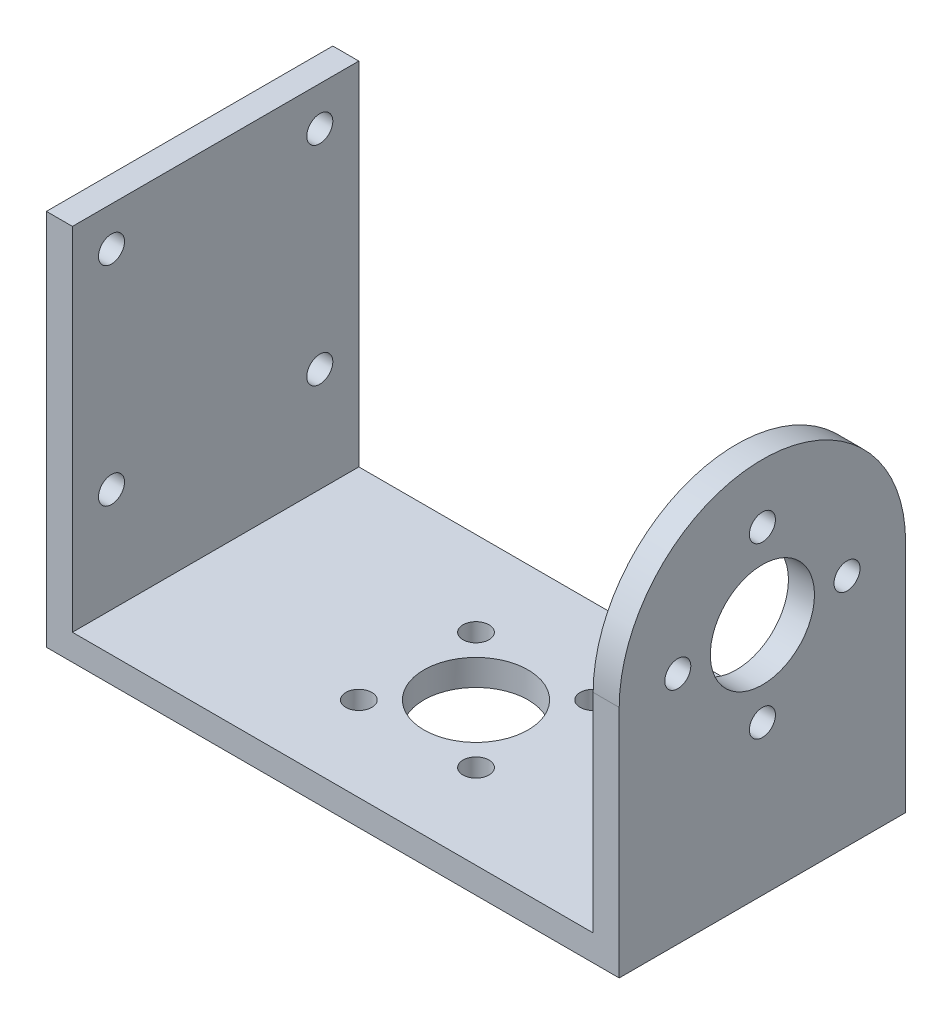
ISO-10303-21;
HEADER;
FILE_DESCRIPTION(('STEP AP214'),'2;1');
FILE_NAME('part.step','',(''),(''),'','','');
FILE_SCHEMA(('AUTOMOTIVE_DESIGN { 1 0 10303 214 1 1 1 1 }'));
ENDSEC;
DATA;
#1=APPLICATION_CONTEXT('core data for automotive mechanical design processes');
#2=APPLICATION_PROTOCOL_DEFINITION('international standard','automotive_design',2000,#1);
#3=PRODUCT_CONTEXT('',#1,'mechanical');
#4=PRODUCT('Part','Part','',(#3));
#5=PRODUCT_RELATED_PRODUCT_CATEGORY('part','',(#4));
#6=PRODUCT_DEFINITION_FORMATION('','',#4);
#7=PRODUCT_DEFINITION_CONTEXT('part definition',#1,'design');
#8=PRODUCT_DEFINITION('design','',#6,#7);
#9=PRODUCT_DEFINITION_SHAPE('','',#8);
#10=(LENGTH_UNIT() NAMED_UNIT(*) SI_UNIT(.MILLI.,.METRE.));
#11=(NAMED_UNIT(*) PLANE_ANGLE_UNIT() SI_UNIT($,.RADIAN.));
#12=(NAMED_UNIT(*) SI_UNIT($,.STERADIAN.) SOLID_ANGLE_UNIT());
#13=UNCERTAINTY_MEASURE_WITH_UNIT(LENGTH_MEASURE(1.E-05),#10,'distance_accuracy_value','');
#14=(GEOMETRIC_REPRESENTATION_CONTEXT(3) GLOBAL_UNCERTAINTY_ASSIGNED_CONTEXT((#13)) GLOBAL_UNIT_ASSIGNED_CONTEXT((#10,
#11,#12)) REPRESENTATION_CONTEXT('',''));
#15=CARTESIAN_POINT('',(0.,0.,0.));
#16=DIRECTION('',(0.,0.,1.));
#17=DIRECTION('',(1.,0.,0.));
#18=AXIS2_PLACEMENT_3D('',#15,#16,#17);
#19=CARTESIAN_POINT('',(0.,2.,-22.));
#20=DIRECTION('',(0.,0.,1.));
#21=DIRECTION('',(1.,0.,0.));
#22=AXIS2_PLACEMENT_3D('',#19,#20,#21);
#23=PLANE('',#22);
#24=DIRECTION('',(1.,0.,0.));
#25=VECTOR('',#24,1.);
#26=CARTESIAN_POINT('',(-0.001000000000001,18.,-22.));
#27=LINE('',#26,#25);
#28=CARTESIAN_POINT('',(42.,18.,-22.));
#29=VERTEX_POINT('',#28);
#30=CARTESIAN_POINT('',(44.,18.,-22.));
#31=VERTEX_POINT('',#30);
#32=EDGE_CURVE('E132',#29,#31,#27,.T.);
#33=ORIENTED_EDGE('',*,*,#32,.T.);
#34=DIRECTION('',(0.,-1.,0.));
#35=VECTOR('',#34,1.);
#36=CARTESIAN_POINT('',(44.,2.,-22.));
#37=LINE('',#36,#35);
#38=CARTESIAN_POINT('',(44.,0.,-22.));
#39=VERTEX_POINT('',#38);
#40=EDGE_CURVE('E129',#31,#39,#37,.T.);
#41=ORIENTED_EDGE('',*,*,#40,.T.);
#42=DIRECTION('',(-1.,0.,0.));
#43=VECTOR('',#42,1.);
#44=CARTESIAN_POINT('',(0.,0.,-22.));
#45=LINE('',#44,#43);
#46=CARTESIAN_POINT('',(0.,0.,-22.));
#47=VERTEX_POINT('',#46);
#48=EDGE_CURVE('E247',#39,#47,#45,.T.);
#49=ORIENTED_EDGE('',*,*,#48,.T.);
#50=DIRECTION('',(0.,-1.,0.));
#51=VECTOR('',#50,1.);
#52=CARTESIAN_POINT('',(0.,2.,-22.));
#53=LINE('',#52,#51);
#54=CARTESIAN_POINT('',(0.,29.,-22.));
#55=VERTEX_POINT('',#54);
#56=EDGE_CURVE('E144',#55,#47,#53,.T.);
#57=ORIENTED_EDGE('',*,*,#56,.F.);
#58=DIRECTION('',(-1.,0.,0.));
#59=VECTOR('',#58,1.);
#60=CARTESIAN_POINT('',(0.,29.,-22.));
#61=LINE('',#60,#59);
#62=CARTESIAN_POINT('',(2.,29.,-22.));
#63=VERTEX_POINT('',#62);
#64=EDGE_CURVE('E233',#63,#55,#61,.T.);
#65=ORIENTED_EDGE('',*,*,#64,.F.);
#66=DIRECTION('',(0.,-1.,0.));
#67=VECTOR('',#66,1.);
#68=CARTESIAN_POINT('',(2.,29.,-22.));
#69=LINE('',#68,#67);
#70=CARTESIAN_POINT('',(2.,2.,-22.));
#71=VERTEX_POINT('',#70);
#72=EDGE_CURVE('E236',#63,#71,#69,.T.);
#73=ORIENTED_EDGE('',*,*,#72,.T.);
#74=DIRECTION('',(-1.,0.,0.));
#75=VECTOR('',#74,1.);
#76=CARTESIAN_POINT('',(0.,2.,-22.));
#77=LINE('',#76,#75);
#78=CARTESIAN_POINT('',(42.,2.,-22.));
#79=VERTEX_POINT('',#78);
#80=EDGE_CURVE('E246',#79,#71,#77,.T.);
#81=ORIENTED_EDGE('',*,*,#80,.F.);
#82=DIRECTION('',(0.,-1.,0.));
#83=VECTOR('',#82,1.);
#84=CARTESIAN_POINT('',(42.,29.,-22.));
#85=LINE('',#84,#83);
#86=EDGE_CURVE('E224',#29,#79,#85,.T.);
#87=ORIENTED_EDGE('',*,*,#86,.F.);
#88=EDGE_LOOP('',(#33,#41,#49,#57,#65,#73,#81,#87));
#89=FACE_BOUND('',#88,.T.);
#90=ADVANCED_FACE('F56',(#89),#23,.F.);
#91=CARTESIAN_POINT('',(0.,2.,0.));
#92=DIRECTION('',(0.,-1.,0.));
#93=DIRECTION('',(0.,0.,-1.));
#94=AXIS2_PLACEMENT_3D('',#91,#92,#93);
#95=PLANE('',#94);
#96=CARTESIAN_POINT('',(17.5,2.,-6.5));
#97=DIRECTION('',(0.,1.,0.));
#98=DIRECTION('',(0.,0.,1.));
#99=AXIS2_PLACEMENT_3D('',#96,#97,#98);
#100=CIRCLE('',#99,1.);
#101=CARTESIAN_POINT('',(17.5,2.,-5.5));
#102=VERTEX_POINT('',#101);
#103=EDGE_CURVE('E403',#102,#102,#100,.T.);
#104=ORIENTED_EDGE('',*,*,#103,.F.);
#105=EDGE_LOOP('',(#104));
#106=FACE_BOUND('',#105,.T.);
#107=CARTESIAN_POINT('',(17.5,2.,-15.5));
#108=DIRECTION('',(0.,1.,0.));
#109=DIRECTION('',(0.,0.,1.));
#110=AXIS2_PLACEMENT_3D('',#107,#108,#109);
#111=CIRCLE('',#110,1.);
#112=CARTESIAN_POINT('',(17.5,2.,-14.5));
#113=VERTEX_POINT('',#112);
#114=EDGE_CURVE('E400',#113,#113,#111,.T.);
#115=ORIENTED_EDGE('',*,*,#114,.F.);
#116=EDGE_LOOP('',(#115));
#117=FACE_BOUND('',#116,.T.);
#118=CARTESIAN_POINT('',(22.,2.,-11.));
#119=DIRECTION('',(0.,1.,0.));
#120=DIRECTION('',(0.,0.,1.));
#121=AXIS2_PLACEMENT_3D('',#118,#119,#120);
#122=CIRCLE('',#121,4.);
#123=CARTESIAN_POINT('',(22.,2.,-7.));
#124=VERTEX_POINT('',#123);
#125=EDGE_CURVE('E395',#124,#124,#122,.T.);
#126=ORIENTED_EDGE('',*,*,#125,.F.);
#127=EDGE_LOOP('',(#126));
#128=FACE_BOUND('',#127,.T.);
#129=CARTESIAN_POINT('',(26.5,2.,-15.5));
#130=DIRECTION('',(0.,1.,0.));
#131=DIRECTION('',(0.,0.,1.));
#132=AXIS2_PLACEMENT_3D('',#129,#130,#131);
#133=CIRCLE('',#132,1.);
#134=CARTESIAN_POINT('',(26.5,2.,-14.5));
#135=VERTEX_POINT('',#134);
#136=EDGE_CURVE('E397',#135,#135,#133,.T.);
#137=ORIENTED_EDGE('',*,*,#136,.F.);
#138=EDGE_LOOP('',(#137));
#139=FACE_BOUND('',#138,.T.);
#140=CARTESIAN_POINT('',(26.5,2.,-6.5));
#141=DIRECTION('',(0.,1.,0.));
#142=DIRECTION('',(0.,0.,1.));
#143=AXIS2_PLACEMENT_3D('',#140,#141,#142);
#144=CIRCLE('',#143,1.);
#145=CARTESIAN_POINT('',(26.5,2.,-5.5));
#146=VERTEX_POINT('',#145);
#147=EDGE_CURVE('E152',#146,#146,#144,.T.);
#148=ORIENTED_EDGE('',*,*,#147,.F.);
#149=EDGE_LOOP('',(#148));
#150=FACE_BOUND('',#149,.T.);
#151=DIRECTION('',(0.,0.,1.));
#152=VECTOR('',#151,1.);
#153=CARTESIAN_POINT('',(42.,2.,-22.));
#154=LINE('',#153,#152);
#155=CARTESIAN_POINT('',(42.,2.,0.));
#156=VERTEX_POINT('',#155);
#157=EDGE_CURVE('E220',#79,#156,#154,.T.);
#158=ORIENTED_EDGE('',*,*,#157,.F.);
#159=ORIENTED_EDGE('',*,*,#80,.T.);
#160=DIRECTION('',(0.,0.,-1.));
#161=VECTOR('',#160,1.);
#162=CARTESIAN_POINT('',(2.,2.,-22.));
#163=LINE('',#162,#161);
#164=CARTESIAN_POINT('',(2.,2.,0.));
#165=VERTEX_POINT('',#164);
#166=EDGE_CURVE('E80',#165,#71,#163,.T.);
#167=ORIENTED_EDGE('',*,*,#166,.F.);
#168=DIRECTION('',(1.,0.,0.));
#169=VECTOR('',#168,1.);
#170=CARTESIAN_POINT('',(0.,2.,0.));
#171=LINE('',#170,#169);
#172=EDGE_CURVE('E244',#165,#156,#171,.T.);
#173=ORIENTED_EDGE('',*,*,#172,.T.);
#174=EDGE_LOOP('',(#158,#159,#167,#173));
#175=FACE_BOUND('',#174,.T.);
#176=ADVANCED_FACE('F289',(#106,#117,#128,#139,#150,#175),#95,.F.);
#177=CARTESIAN_POINT('',(0.,2.,0.));
#178=DIRECTION('',(1.,0.,0.));
#179=DIRECTION('',(0.,0.,-1.));
#180=AXIS2_PLACEMENT_3D('',#177,#178,#179);
#181=PLANE('',#180);
#182=CARTESIAN_POINT('',(0.,26.,-19.));
#183=DIRECTION('',(-1.,0.,0.));
#184=DIRECTION('',(0.,0.,1.));
#185=AXIS2_PLACEMENT_3D('',#182,#183,#184);
#186=CIRCLE('',#185,1.);
#187=CARTESIAN_POINT('',(0.,26.,-18.));
#188=VERTEX_POINT('',#187);
#189=EDGE_CURVE('E206',#188,#188,#186,.T.);
#190=ORIENTED_EDGE('',*,*,#189,.F.);
#191=EDGE_LOOP('',(#190));
#192=FACE_BOUND('',#191,.T.);
#193=CARTESIAN_POINT('',(0.,10.,-3.));
#194=DIRECTION('',(-1.,0.,0.));
#195=DIRECTION('',(0.,0.,1.));
#196=AXIS2_PLACEMENT_3D('',#193,#194,#195);
#197=CIRCLE('',#196,1.);
#198=CARTESIAN_POINT('',(0.,10.,-2.));
#199=VERTEX_POINT('',#198);
#200=EDGE_CURVE('E199',#199,#199,#197,.T.);
#201=ORIENTED_EDGE('',*,*,#200,.F.);
#202=EDGE_LOOP('',(#201));
#203=FACE_BOUND('',#202,.T.);
#204=CARTESIAN_POINT('',(0.,26.,-3.));
#205=DIRECTION('',(-1.,0.,0.));
#206=DIRECTION('',(0.,0.,1.));
#207=AXIS2_PLACEMENT_3D('',#204,#205,#206);
#208=CIRCLE('',#207,1.);
#209=CARTESIAN_POINT('',(0.,26.,-2.));
#210=VERTEX_POINT('',#209);
#211=EDGE_CURVE('E195',#210,#210,#208,.T.);
#212=ORIENTED_EDGE('',*,*,#211,.F.);
#213=EDGE_LOOP('',(#212));
#214=FACE_BOUND('',#213,.T.);
#215=CARTESIAN_POINT('',(0.,10.,-19.));
#216=DIRECTION('',(-1.,0.,0.));
#217=DIRECTION('',(0.,0.,1.));
#218=AXIS2_PLACEMENT_3D('',#215,#216,#217);
#219=CIRCLE('',#218,1.);
#220=CARTESIAN_POINT('',(0.,10.,-18.));
#221=VERTEX_POINT('',#220);
#222=EDGE_CURVE('E205',#221,#221,#219,.T.);
#223=ORIENTED_EDGE('',*,*,#222,.F.);
#224=EDGE_LOOP('',(#223));
#225=FACE_BOUND('',#224,.T.);
#226=DIRECTION('',(0.,0.,1.));
#227=VECTOR('',#226,1.);
#228=CARTESIAN_POINT('',(0.,0.,0.));
#229=LINE('',#228,#227);
#230=CARTESIAN_POINT('',(0.,0.,0.));
#231=VERTEX_POINT('',#230);
#232=EDGE_CURVE('E243',#47,#231,#229,.T.);
#233=ORIENTED_EDGE('',*,*,#232,.T.);
#234=DIRECTION('',(0.,-1.,0.));
#235=VECTOR('',#234,1.);
#236=CARTESIAN_POINT('',(0.,2.,0.));
#237=LINE('',#236,#235);
#238=CARTESIAN_POINT('',(0.,29.,0.));
#239=VERTEX_POINT('',#238);
#240=EDGE_CURVE('E12',#239,#231,#237,.T.);
#241=ORIENTED_EDGE('',*,*,#240,.F.);
#242=DIRECTION('',(0.,0.,1.));
#243=VECTOR('',#242,1.);
#244=CARTESIAN_POINT('',(0.,29.,-22.));
#245=LINE('',#244,#243);
#246=EDGE_CURVE('E226',#55,#239,#245,.T.);
#247=ORIENTED_EDGE('',*,*,#246,.F.);
#248=ORIENTED_EDGE('',*,*,#56,.T.);
#249=EDGE_LOOP('',(#233,#241,#247,#248));
#250=FACE_BOUND('',#249,.T.);
#251=ADVANCED_FACE('F58',(#192,#203,#214,#225,#250),#181,.F.);
#252=CARTESIAN_POINT('',(0.,2.,0.));
#253=DIRECTION('',(0.,0.,-1.));
#254=DIRECTION('',(-1.,0.,0.));
#255=AXIS2_PLACEMENT_3D('',#252,#253,#254);
#256=PLANE('',#255);
#257=DIRECTION('',(0.,-1.,0.));
#258=VECTOR('',#257,1.);
#259=CARTESIAN_POINT('',(44.,2.,0.));
#260=LINE('',#259,#258);
#261=CARTESIAN_POINT('',(44.,18.,0.));
#262=VERTEX_POINT('',#261);
#263=CARTESIAN_POINT('',(44.,0.,0.));
#264=VERTEX_POINT('',#263);
#265=EDGE_CURVE('E65',#262,#264,#260,.T.);
#266=ORIENTED_EDGE('',*,*,#265,.F.);
#267=DIRECTION('',(1.,0.,0.));
#268=VECTOR('',#267,1.);
#269=CARTESIAN_POINT('',(-0.001000000000001,18.,0.));
#270=LINE('',#269,#268);
#271=CARTESIAN_POINT('',(42.,18.,0.));
#272=VERTEX_POINT('',#271);
#273=EDGE_CURVE('E135',#272,#262,#270,.T.);
#274=ORIENTED_EDGE('',*,*,#273,.F.);
#275=DIRECTION('',(0.,-1.,0.));
#276=VECTOR('',#275,1.);
#277=CARTESIAN_POINT('',(42.,29.,0.));
#278=LINE('',#277,#276);
#279=EDGE_CURVE('E73',#272,#156,#278,.T.);
#280=ORIENTED_EDGE('',*,*,#279,.T.);
#281=ORIENTED_EDGE('',*,*,#172,.F.);
#282=DIRECTION('',(0.,-1.,0.));
#283=VECTOR('',#282,1.);
#284=CARTESIAN_POINT('',(2.,29.,0.));
#285=LINE('',#284,#283);
#286=CARTESIAN_POINT('',(2.,29.,0.));
#287=VERTEX_POINT('',#286);
#288=EDGE_CURVE('E240',#287,#165,#285,.T.);
#289=ORIENTED_EDGE('',*,*,#288,.F.);
#290=DIRECTION('',(1.,0.,0.));
#291=VECTOR('',#290,1.);
#292=CARTESIAN_POINT('',(0.,29.,0.));
#293=LINE('',#292,#291);
#294=EDGE_CURVE('E229',#239,#287,#293,.T.);
#295=ORIENTED_EDGE('',*,*,#294,.F.);
#296=ORIENTED_EDGE('',*,*,#240,.T.);
#297=DIRECTION('',(1.,0.,0.));
#298=VECTOR('',#297,1.);
#299=CARTESIAN_POINT('',(0.,0.,0.));
#300=LINE('',#299,#298);
#301=EDGE_CURVE('E141',#231,#264,#300,.T.);
#302=ORIENTED_EDGE('',*,*,#301,.T.);
#303=EDGE_LOOP('',(#266,#274,#280,#281,#289,#295,#296,#302));
#304=FACE_BOUND('',#303,.T.);
#305=ADVANCED_FACE('F140',(#304),#256,.F.);
#306=CARTESIAN_POINT('',(44.,2.,0.));
#307=DIRECTION('',(-1.,0.,0.));
#308=DIRECTION('',(0.,0.,1.));
#309=AXIS2_PLACEMENT_3D('',#306,#307,#308);
#310=PLANE('',#309);
#311=CARTESIAN_POINT('',(44.,18.,-17.5));
#312=DIRECTION('',(1.,0.,0.));
#313=DIRECTION('',(0.,0.,-1.));
#314=AXIS2_PLACEMENT_3D('',#311,#312,#313);
#315=CIRCLE('',#314,1.);
#316=CARTESIAN_POINT('',(44.,18.,-18.5));
#317=VERTEX_POINT('',#316);
#318=EDGE_CURVE('E180',#317,#317,#315,.T.);
#319=ORIENTED_EDGE('',*,*,#318,.F.);
#320=EDGE_LOOP('',(#319));
#321=FACE_BOUND('',#320,.T.);
#322=CARTESIAN_POINT('',(44.,24.5,-11.));
#323=DIRECTION('',(1.,0.,0.));
#324=DIRECTION('',(0.,0.,-1.));
#325=AXIS2_PLACEMENT_3D('',#322,#323,#324);
#326=CIRCLE('',#325,1.);
#327=CARTESIAN_POINT('',(44.,24.5,-12.));
#328=VERTEX_POINT('',#327);
#329=EDGE_CURVE('E181',#328,#328,#326,.T.);
#330=ORIENTED_EDGE('',*,*,#329,.F.);
#331=EDGE_LOOP('',(#330));
#332=FACE_BOUND('',#331,.T.);
#333=CARTESIAN_POINT('',(44.,18.,-4.5));
#334=DIRECTION('',(1.,0.,0.));
#335=DIRECTION('',(0.,0.,-1.));
#336=AXIS2_PLACEMENT_3D('',#333,#334,#335);
#337=CIRCLE('',#336,1.);
#338=CARTESIAN_POINT('',(44.,18.,-5.5));
#339=VERTEX_POINT('',#338);
#340=EDGE_CURVE('E174',#339,#339,#337,.T.);
#341=ORIENTED_EDGE('',*,*,#340,.F.);
#342=EDGE_LOOP('',(#341));
#343=FACE_BOUND('',#342,.T.);
#344=CARTESIAN_POINT('',(44.,11.5,-11.));
#345=DIRECTION('',(1.,0.,0.));
#346=DIRECTION('',(0.,0.,-1.));
#347=AXIS2_PLACEMENT_3D('',#344,#345,#346);
#348=CIRCLE('',#347,0.999999999999999);
#349=CARTESIAN_POINT('',(44.,11.5,-12.));
#350=VERTEX_POINT('',#349);
#351=EDGE_CURVE('E166',#350,#350,#348,.T.);
#352=ORIENTED_EDGE('',*,*,#351,.F.);
#353=EDGE_LOOP('',(#352));
#354=FACE_BOUND('',#353,.T.);
#355=CARTESIAN_POINT('',(44.,18.,-11.));
#356=DIRECTION('',(1.,0.,0.));
#357=DIRECTION('',(0.,0.,-1.));
#358=AXIS2_PLACEMENT_3D('',#355,#356,#357);
#359=CIRCLE('',#358,4.);
#360=CARTESIAN_POINT('',(44.,18.,-15.));
#361=VERTEX_POINT('',#360);
#362=EDGE_CURVE('E192',#361,#361,#359,.T.);
#363=ORIENTED_EDGE('',*,*,#362,.F.);
#364=EDGE_LOOP('',(#363));
#365=FACE_BOUND('',#364,.T.);
#366=CARTESIAN_POINT('',(44.,18.,-11.));
#367=DIRECTION('',(1.,0.,0.));
#368=DIRECTION('',(0.,0.,-1.));
#369=AXIS2_PLACEMENT_3D('',#366,#367,#368);
#370=CIRCLE('',#369,11.);
#371=EDGE_CURVE('E123',#262,#31,#370,.F.);
#372=ORIENTED_EDGE('',*,*,#371,.F.);
#373=ORIENTED_EDGE('',*,*,#265,.T.);
#374=DIRECTION('',(0.,0.,-1.));
#375=VECTOR('',#374,1.);
#376=CARTESIAN_POINT('',(44.,0.,0.));
#377=LINE('',#376,#375);
#378=EDGE_CURVE('E252',#264,#39,#377,.T.);
#379=ORIENTED_EDGE('',*,*,#378,.T.);
#380=ORIENTED_EDGE('',*,*,#40,.F.);
#381=EDGE_LOOP('',(#372,#373,#379,#380));
#382=FACE_BOUND('',#381,.T.);
#383=ADVANCED_FACE('F125',(#321,#332,#343,#354,#365,#382),#310,.F.);
#384=CARTESIAN_POINT('',(0.,0.,0.));
#385=DIRECTION('',(0.,-1.,0.));
#386=DIRECTION('',(0.,0.,-1.));
#387=AXIS2_PLACEMENT_3D('',#384,#385,#386);
#388=PLANE('',#387);
#389=CARTESIAN_POINT('',(17.5,0.,-6.5));
#390=DIRECTION('',(0.,-1.,0.));
#391=DIRECTION('',(0.,0.,-1.));
#392=AXIS2_PLACEMENT_3D('',#389,#390,#391);
#393=CIRCLE('',#392,1.);
#394=CARTESIAN_POINT('',(17.5,0.,-7.5));
#395=VERTEX_POINT('',#394);
#396=EDGE_CURVE('E60',#395,#395,#393,.T.);
#397=ORIENTED_EDGE('',*,*,#396,.F.);
#398=EDGE_LOOP('',(#397));
#399=FACE_BOUND('',#398,.T.);
#400=CARTESIAN_POINT('',(17.5,0.,-15.5));
#401=DIRECTION('',(0.,-1.,0.));
#402=DIRECTION('',(0.,0.,-1.));
#403=AXIS2_PLACEMENT_3D('',#400,#401,#402);
#404=CIRCLE('',#403,1.);
#405=CARTESIAN_POINT('',(17.5,0.,-16.5));
#406=VERTEX_POINT('',#405);
#407=EDGE_CURVE('E157',#406,#406,#404,.T.);
#408=ORIENTED_EDGE('',*,*,#407,.F.);
#409=EDGE_LOOP('',(#408));
#410=FACE_BOUND('',#409,.T.);
#411=CARTESIAN_POINT('',(22.,0.,-11.));
#412=DIRECTION('',(0.,-1.,0.));
#413=DIRECTION('',(0.,0.,-1.));
#414=AXIS2_PLACEMENT_3D('',#411,#412,#413);
#415=CIRCLE('',#414,4.);
#416=CARTESIAN_POINT('',(22.,0.,-15.));
#417=VERTEX_POINT('',#416);
#418=EDGE_CURVE('E155',#417,#417,#415,.T.);
#419=ORIENTED_EDGE('',*,*,#418,.F.);
#420=EDGE_LOOP('',(#419));
#421=FACE_BOUND('',#420,.T.);
#422=CARTESIAN_POINT('',(26.5,0.,-15.5));
#423=DIRECTION('',(0.,-1.,0.));
#424=DIRECTION('',(0.,0.,-1.));
#425=AXIS2_PLACEMENT_3D('',#422,#423,#424);
#426=CIRCLE('',#425,1.);
#427=CARTESIAN_POINT('',(26.5,0.,-16.5));
#428=VERTEX_POINT('',#427);
#429=EDGE_CURVE('E151',#428,#428,#426,.T.);
#430=ORIENTED_EDGE('',*,*,#429,.F.);
#431=EDGE_LOOP('',(#430));
#432=FACE_BOUND('',#431,.T.);
#433=CARTESIAN_POINT('',(26.5,0.,-6.5));
#434=DIRECTION('',(0.,-1.,0.));
#435=DIRECTION('',(0.,0.,-1.));
#436=AXIS2_PLACEMENT_3D('',#433,#434,#435);
#437=CIRCLE('',#436,1.);
#438=CARTESIAN_POINT('',(26.5,0.,-7.5));
#439=VERTEX_POINT('',#438);
#440=EDGE_CURVE('E148',#439,#439,#437,.T.);
#441=ORIENTED_EDGE('',*,*,#440,.F.);
#442=EDGE_LOOP('',(#441));
#443=FACE_BOUND('',#442,.T.);
#444=ORIENTED_EDGE('',*,*,#232,.F.);
#445=ORIENTED_EDGE('',*,*,#48,.F.);
#446=ORIENTED_EDGE('',*,*,#378,.F.);
#447=ORIENTED_EDGE('',*,*,#301,.F.);
#448=EDGE_LOOP('',(#444,#445,#446,#447));
#449=FACE_BOUND('',#448,.T.);
#450=ADVANCED_FACE('F262',(#399,#410,#421,#432,#443,#449),#388,.T.);
#451=CARTESIAN_POINT('',(2.,29.,-22.));
#452=DIRECTION('',(-1.,0.,0.));
#453=DIRECTION('',(0.,0.,1.));
#454=AXIS2_PLACEMENT_3D('',#451,#452,#453);
#455=PLANE('',#454);
#456=CARTESIAN_POINT('',(2.,26.,-19.));
#457=DIRECTION('',(-1.,0.,0.));
#458=DIRECTION('',(0.,0.,1.));
#459=AXIS2_PLACEMENT_3D('',#456,#457,#458);
#460=CIRCLE('',#459,1.);
#461=CARTESIAN_POINT('',(2.,26.,-18.));
#462=VERTEX_POINT('',#461);
#463=EDGE_CURVE('E202',#462,#462,#460,.F.);
#464=ORIENTED_EDGE('',*,*,#463,.F.);
#465=EDGE_LOOP('',(#464));
#466=FACE_BOUND('',#465,.T.);
#467=CARTESIAN_POINT('',(2.,10.,-3.));
#468=DIRECTION('',(-1.,0.,0.));
#469=DIRECTION('',(0.,0.,1.));
#470=AXIS2_PLACEMENT_3D('',#467,#468,#469);
#471=CIRCLE('',#470,1.);
#472=CARTESIAN_POINT('',(2.,10.,-2.));
#473=VERTEX_POINT('',#472);
#474=EDGE_CURVE('E209',#473,#473,#471,.F.);
#475=ORIENTED_EDGE('',*,*,#474,.F.);
#476=EDGE_LOOP('',(#475));
#477=FACE_BOUND('',#476,.T.);
#478=CARTESIAN_POINT('',(2.,26.,-3.));
#479=DIRECTION('',(-1.,0.,0.));
#480=DIRECTION('',(0.,0.,1.));
#481=AXIS2_PLACEMENT_3D('',#478,#479,#480);
#482=CIRCLE('',#481,1.);
#483=CARTESIAN_POINT('',(2.,26.,-2.));
#484=VERTEX_POINT('',#483);
#485=EDGE_CURVE('E196',#484,#484,#482,.F.);
#486=ORIENTED_EDGE('',*,*,#485,.F.);
#487=EDGE_LOOP('',(#486));
#488=FACE_BOUND('',#487,.T.);
#489=CARTESIAN_POINT('',(2.,10.,-19.));
#490=DIRECTION('',(-1.,0.,0.));
#491=DIRECTION('',(0.,0.,1.));
#492=AXIS2_PLACEMENT_3D('',#489,#490,#491);
#493=CIRCLE('',#492,1.);
#494=CARTESIAN_POINT('',(2.,10.,-18.));
#495=VERTEX_POINT('',#494);
#496=EDGE_CURVE('E138',#495,#495,#493,.F.);
#497=ORIENTED_EDGE('',*,*,#496,.F.);
#498=EDGE_LOOP('',(#497));
#499=FACE_BOUND('',#498,.T.);
#500=ORIENTED_EDGE('',*,*,#166,.T.);
#501=ORIENTED_EDGE('',*,*,#72,.F.);
#502=DIRECTION('',(0.,0.,-1.));
#503=VECTOR('',#502,1.);
#504=CARTESIAN_POINT('',(2.,29.,-22.));
#505=LINE('',#504,#503);
#506=EDGE_CURVE('E231',#287,#63,#505,.T.);
#507=ORIENTED_EDGE('',*,*,#506,.F.);
#508=ORIENTED_EDGE('',*,*,#288,.T.);
#509=EDGE_LOOP('',(#500,#501,#507,#508));
#510=FACE_BOUND('',#509,.T.);
#511=ADVANCED_FACE('F273',(#466,#477,#488,#499,#510),#455,.F.);
#512=CARTESIAN_POINT('',(0.,29.,0.));
#513=DIRECTION('',(0.,1.,0.));
#514=DIRECTION('',(0.,0.,1.));
#515=AXIS2_PLACEMENT_3D('',#512,#513,#514);
#516=PLANE('',#515);
#517=ORIENTED_EDGE('',*,*,#246,.T.);
#518=ORIENTED_EDGE('',*,*,#294,.T.);
#519=ORIENTED_EDGE('',*,*,#506,.T.);
#520=ORIENTED_EDGE('',*,*,#64,.T.);
#521=EDGE_LOOP('',(#517,#518,#519,#520));
#522=FACE_BOUND('',#521,.T.);
#523=ADVANCED_FACE('F267',(#522),#516,.T.);
#524=CARTESIAN_POINT('',(42.,29.,-22.));
#525=DIRECTION('',(1.,0.,0.));
#526=DIRECTION('',(0.,0.,-1.));
#527=AXIS2_PLACEMENT_3D('',#524,#525,#526);
#528=PLANE('',#527);
#529=CARTESIAN_POINT('',(42.,18.,-17.5));
#530=DIRECTION('',(1.,0.,0.));
#531=DIRECTION('',(0.,0.,-1.));
#532=AXIS2_PLACEMENT_3D('',#529,#530,#531);
#533=CIRCLE('',#532,1.);
#534=CARTESIAN_POINT('',(42.,18.,-18.5));
#535=VERTEX_POINT('',#534);
#536=EDGE_CURVE('E177',#535,#535,#533,.F.);
#537=ORIENTED_EDGE('',*,*,#536,.F.);
#538=EDGE_LOOP('',(#537));
#539=FACE_BOUND('',#538,.T.);
#540=CARTESIAN_POINT('',(42.,24.5,-11.));
#541=DIRECTION('',(1.,0.,0.));
#542=DIRECTION('',(0.,0.,-1.));
#543=AXIS2_PLACEMENT_3D('',#540,#541,#542);
#544=CIRCLE('',#543,1.);
#545=CARTESIAN_POINT('',(42.,24.5,-12.));
#546=VERTEX_POINT('',#545);
#547=EDGE_CURVE('E185',#546,#546,#544,.F.);
#548=ORIENTED_EDGE('',*,*,#547,.F.);
#549=EDGE_LOOP('',(#548));
#550=FACE_BOUND('',#549,.T.);
#551=CARTESIAN_POINT('',(42.,18.,-4.5));
#552=DIRECTION('',(1.,0.,0.));
#553=DIRECTION('',(0.,0.,-1.));
#554=AXIS2_PLACEMENT_3D('',#551,#552,#553);
#555=CIRCLE('',#554,1.);
#556=CARTESIAN_POINT('',(42.,18.,-5.5));
#557=VERTEX_POINT('',#556);
#558=EDGE_CURVE('E171',#557,#557,#555,.F.);
#559=ORIENTED_EDGE('',*,*,#558,.F.);
#560=EDGE_LOOP('',(#559));
#561=FACE_BOUND('',#560,.T.);
#562=CARTESIAN_POINT('',(42.,11.5,-11.));
#563=DIRECTION('',(1.,0.,0.));
#564=DIRECTION('',(0.,0.,-1.));
#565=AXIS2_PLACEMENT_3D('',#562,#563,#564);
#566=CIRCLE('',#565,0.999999999999999);
#567=CARTESIAN_POINT('',(42.,11.5,-12.));
#568=VERTEX_POINT('',#567);
#569=EDGE_CURVE('E162',#568,#568,#566,.F.);
#570=ORIENTED_EDGE('',*,*,#569,.F.);
#571=EDGE_LOOP('',(#570));
#572=FACE_BOUND('',#571,.T.);
#573=CARTESIAN_POINT('',(42.,18.,-11.));
#574=DIRECTION('',(1.,0.,0.));
#575=DIRECTION('',(0.,0.,-1.));
#576=AXIS2_PLACEMENT_3D('',#573,#574,#575);
#577=CIRCLE('',#576,4.);
#578=CARTESIAN_POINT('',(42.,18.,-15.));
#579=VERTEX_POINT('',#578);
#580=EDGE_CURVE('E184',#579,#579,#577,.F.);
#581=ORIENTED_EDGE('',*,*,#580,.F.);
#582=EDGE_LOOP('',(#581));
#583=FACE_BOUND('',#582,.T.);
#584=ORIENTED_EDGE('',*,*,#279,.F.);
#585=CARTESIAN_POINT('',(42.,18.,-11.));
#586=DIRECTION('',(1.,0.,0.));
#587=DIRECTION('',(0.,0.,-1.));
#588=AXIS2_PLACEMENT_3D('',#585,#586,#587);
#589=CIRCLE('',#588,11.);
#590=EDGE_CURVE('E133',#29,#272,#589,.T.);
#591=ORIENTED_EDGE('',*,*,#590,.F.);
#592=ORIENTED_EDGE('',*,*,#86,.T.);
#593=ORIENTED_EDGE('',*,*,#157,.T.);
#594=EDGE_LOOP('',(#584,#591,#592,#593));
#595=FACE_BOUND('',#594,.T.);
#596=ADVANCED_FACE('F281',(#539,#550,#561,#572,#583,#595),#528,.F.);
#597=CARTESIAN_POINT('',(-0.001000000000001,18.,-11.));
#598=DIRECTION('',(1.,0.,0.));
#599=DIRECTION('',(0.,0.,-1.));
#600=AXIS2_PLACEMENT_3D('',#597,#598,#599);
#601=CYLINDRICAL_SURFACE('',#600,11.);
#602=ORIENTED_EDGE('',*,*,#590,.T.);
#603=ORIENTED_EDGE('',*,*,#273,.T.);
#604=ORIENTED_EDGE('',*,*,#371,.T.);
#605=ORIENTED_EDGE('',*,*,#32,.F.);
#606=EDGE_LOOP('',(#602,#603,#604,#605));
#607=FACE_BOUND('',#606,.T.);
#608=ADVANCED_FACE('F136',(#607),#601,.T.);
#609=CARTESIAN_POINT('',(44.001,10.,-19.));
#610=DIRECTION('',(-1.,0.,0.));
#611=DIRECTION('',(0.,0.,1.));
#612=AXIS2_PLACEMENT_3D('',#609,#610,#611);
#613=CYLINDRICAL_SURFACE('',#612,1.);
#614=ORIENTED_EDGE('',*,*,#222,.T.);
#615=EDGE_LOOP('',(#614));
#616=FACE_BOUND('',#615,.T.);
#617=ORIENTED_EDGE('',*,*,#496,.T.);
#618=EDGE_LOOP('',(#617));
#619=FACE_BOUND('',#618,.T.);
#620=ADVANCED_FACE('F313',(#616,#619),#613,.F.);
#621=CARTESIAN_POINT('',(44.001,26.,-3.));
#622=DIRECTION('',(-1.,0.,0.));
#623=DIRECTION('',(0.,0.,1.));
#624=AXIS2_PLACEMENT_3D('',#621,#622,#623);
#625=CYLINDRICAL_SURFACE('',#624,1.);
#626=ORIENTED_EDGE('',*,*,#211,.T.);
#627=EDGE_LOOP('',(#626));
#628=FACE_BOUND('',#627,.T.);
#629=ORIENTED_EDGE('',*,*,#485,.T.);
#630=EDGE_LOOP('',(#629));
#631=FACE_BOUND('',#630,.T.);
#632=ADVANCED_FACE('F316',(#628,#631),#625,.F.);
#633=CARTESIAN_POINT('',(44.001,10.,-3.));
#634=DIRECTION('',(-1.,0.,0.));
#635=DIRECTION('',(0.,0.,1.));
#636=AXIS2_PLACEMENT_3D('',#633,#634,#635);
#637=CYLINDRICAL_SURFACE('',#636,1.);
#638=ORIENTED_EDGE('',*,*,#200,.T.);
#639=EDGE_LOOP('',(#638));
#640=FACE_BOUND('',#639,.T.);
#641=ORIENTED_EDGE('',*,*,#474,.T.);
#642=EDGE_LOOP('',(#641));
#643=FACE_BOUND('',#642,.T.);
#644=ADVANCED_FACE('F324',(#640,#643),#637,.F.);
#645=CARTESIAN_POINT('',(44.001,26.,-19.));
#646=DIRECTION('',(-1.,0.,0.));
#647=DIRECTION('',(0.,0.,1.));
#648=AXIS2_PLACEMENT_3D('',#645,#646,#647);
#649=CYLINDRICAL_SURFACE('',#648,1.);
#650=ORIENTED_EDGE('',*,*,#189,.T.);
#651=EDGE_LOOP('',(#650));
#652=FACE_BOUND('',#651,.T.);
#653=ORIENTED_EDGE('',*,*,#463,.T.);
#654=EDGE_LOOP('',(#653));
#655=FACE_BOUND('',#654,.T.);
#656=ADVANCED_FACE('F349',(#652,#655),#649,.F.);
#657=CARTESIAN_POINT('',(-0.001000000000001,18.,-11.));
#658=DIRECTION('',(1.,0.,0.));
#659=DIRECTION('',(0.,0.,-1.));
#660=AXIS2_PLACEMENT_3D('',#657,#658,#659);
#661=CYLINDRICAL_SURFACE('',#660,4.);
#662=ORIENTED_EDGE('',*,*,#362,.T.);
#663=EDGE_LOOP('',(#662));
#664=FACE_BOUND('',#663,.T.);
#665=ORIENTED_EDGE('',*,*,#580,.T.);
#666=EDGE_LOOP('',(#665));
#667=FACE_BOUND('',#666,.T.);
#668=ADVANCED_FACE('F346',(#664,#667),#661,.F.);
#669=CARTESIAN_POINT('',(-0.001000000000001,11.5,-11.));
#670=DIRECTION('',(1.,0.,0.));
#671=DIRECTION('',(0.,0.,-1.));
#672=AXIS2_PLACEMENT_3D('',#669,#670,#671);
#673=CYLINDRICAL_SURFACE('',#672,0.999999999999999);
#674=ORIENTED_EDGE('',*,*,#351,.T.);
#675=EDGE_LOOP('',(#674));
#676=FACE_BOUND('',#675,.T.);
#677=ORIENTED_EDGE('',*,*,#569,.T.);
#678=EDGE_LOOP('',(#677));
#679=FACE_BOUND('',#678,.T.);
#680=ADVANCED_FACE('F348',(#676,#679),#673,.F.);
#681=CARTESIAN_POINT('',(-0.001000000000001,18.,-4.5));
#682=DIRECTION('',(1.,0.,0.));
#683=DIRECTION('',(0.,0.,-1.));
#684=AXIS2_PLACEMENT_3D('',#681,#682,#683);
#685=CYLINDRICAL_SURFACE('',#684,1.);
#686=ORIENTED_EDGE('',*,*,#340,.T.);
#687=EDGE_LOOP('',(#686));
#688=FACE_BOUND('',#687,.T.);
#689=ORIENTED_EDGE('',*,*,#558,.T.);
#690=EDGE_LOOP('',(#689));
#691=FACE_BOUND('',#690,.T.);
#692=ADVANCED_FACE('F356',(#688,#691),#685,.F.);
#693=CARTESIAN_POINT('',(-0.001000000000001,24.5,-11.));
#694=DIRECTION('',(1.,0.,0.));
#695=DIRECTION('',(0.,0.,-1.));
#696=AXIS2_PLACEMENT_3D('',#693,#694,#695);
#697=CYLINDRICAL_SURFACE('',#696,1.);
#698=ORIENTED_EDGE('',*,*,#329,.T.);
#699=EDGE_LOOP('',(#698));
#700=FACE_BOUND('',#699,.T.);
#701=ORIENTED_EDGE('',*,*,#547,.T.);
#702=EDGE_LOOP('',(#701));
#703=FACE_BOUND('',#702,.T.);
#704=ADVANCED_FACE('F361',(#700,#703),#697,.F.);
#705=CARTESIAN_POINT('',(-0.001000000000001,18.,-17.5));
#706=DIRECTION('',(1.,0.,0.));
#707=DIRECTION('',(0.,0.,-1.));
#708=AXIS2_PLACEMENT_3D('',#705,#706,#707);
#709=CYLINDRICAL_SURFACE('',#708,1.);
#710=ORIENTED_EDGE('',*,*,#318,.T.);
#711=EDGE_LOOP('',(#710));
#712=FACE_BOUND('',#711,.T.);
#713=ORIENTED_EDGE('',*,*,#536,.T.);
#714=EDGE_LOOP('',(#713));
#715=FACE_BOUND('',#714,.T.);
#716=ADVANCED_FACE('F364',(#712,#715),#709,.F.);
#717=CARTESIAN_POINT('',(26.5,-14.3137084989879,-6.5));
#718=DIRECTION('',(0.,1.,0.));
#719=DIRECTION('',(0.,0.,1.));
#720=AXIS2_PLACEMENT_3D('',#717,#718,#719);
#721=CYLINDRICAL_SURFACE('',#720,1.);
#722=ORIENTED_EDGE('',*,*,#440,.T.);
#723=EDGE_LOOP('',(#722));
#724=FACE_BOUND('',#723,.T.);
#725=ORIENTED_EDGE('',*,*,#147,.T.);
#726=EDGE_LOOP('',(#725));
#727=FACE_BOUND('',#726,.T.);
#728=ADVANCED_FACE('F367',(#724,#727),#721,.F.);
#729=CARTESIAN_POINT('',(26.5,-14.3137084989879,-15.5));
#730=DIRECTION('',(0.,1.,0.));
#731=DIRECTION('',(0.,0.,1.));
#732=AXIS2_PLACEMENT_3D('',#729,#730,#731);
#733=CYLINDRICAL_SURFACE('',#732,1.);
#734=ORIENTED_EDGE('',*,*,#429,.T.);
#735=EDGE_LOOP('',(#734));
#736=FACE_BOUND('',#735,.T.);
#737=ORIENTED_EDGE('',*,*,#136,.T.);
#738=EDGE_LOOP('',(#737));
#739=FACE_BOUND('',#738,.T.);
#740=ADVANCED_FACE('F375',(#736,#739),#733,.F.);
#741=CARTESIAN_POINT('',(22.,-14.3137084989879,-11.));
#742=DIRECTION('',(0.,1.,0.));
#743=DIRECTION('',(0.,0.,1.));
#744=AXIS2_PLACEMENT_3D('',#741,#742,#743);
#745=CYLINDRICAL_SURFACE('',#744,4.);
#746=ORIENTED_EDGE('',*,*,#418,.T.);
#747=EDGE_LOOP('',(#746));
#748=FACE_BOUND('',#747,.T.);
#749=ORIENTED_EDGE('',*,*,#125,.T.);
#750=EDGE_LOOP('',(#749));
#751=FACE_BOUND('',#750,.T.);
#752=ADVANCED_FACE('F381',(#748,#751),#745,.F.);
#753=CARTESIAN_POINT('',(17.5,-14.3137084989879,-15.5));
#754=DIRECTION('',(0.,1.,0.));
#755=DIRECTION('',(0.,0.,1.));
#756=AXIS2_PLACEMENT_3D('',#753,#754,#755);
#757=CYLINDRICAL_SURFACE('',#756,1.);
#758=ORIENTED_EDGE('',*,*,#407,.T.);
#759=EDGE_LOOP('',(#758));
#760=FACE_BOUND('',#759,.T.);
#761=ORIENTED_EDGE('',*,*,#114,.T.);
#762=EDGE_LOOP('',(#761));
#763=FACE_BOUND('',#762,.T.);
#764=ADVANCED_FACE('F377',(#760,#763),#757,.F.);
#765=CARTESIAN_POINT('',(17.5,-14.3137084989879,-6.5));
#766=DIRECTION('',(0.,1.,0.));
#767=DIRECTION('',(0.,0.,1.));
#768=AXIS2_PLACEMENT_3D('',#765,#766,#767);
#769=CYLINDRICAL_SURFACE('',#768,1.);
#770=ORIENTED_EDGE('',*,*,#396,.T.);
#771=EDGE_LOOP('',(#770));
#772=FACE_BOUND('',#771,.T.);
#773=ORIENTED_EDGE('',*,*,#103,.T.);
#774=EDGE_LOOP('',(#773));
#775=FACE_BOUND('',#774,.T.);
#776=ADVANCED_FACE('F380',(#772,#775),#769,.F.);
#777=CLOSED_SHELL('',(#90,#176,#251,#305,#383,#450,#511,#523,#596,#608,#620,#632,#644,#656,#668,
#680,#692,#704,#716,#728,#740,#752,#764,#776));
#778=MANIFOLD_SOLID_BREP('B2',#777);
#779=ADVANCED_BREP_SHAPE_REPRESENTATION('',(#18,#778),#14);
#780=SHAPE_DEFINITION_REPRESENTATION(#9,#779);
ENDSEC;
END-ISO-10303-21;
